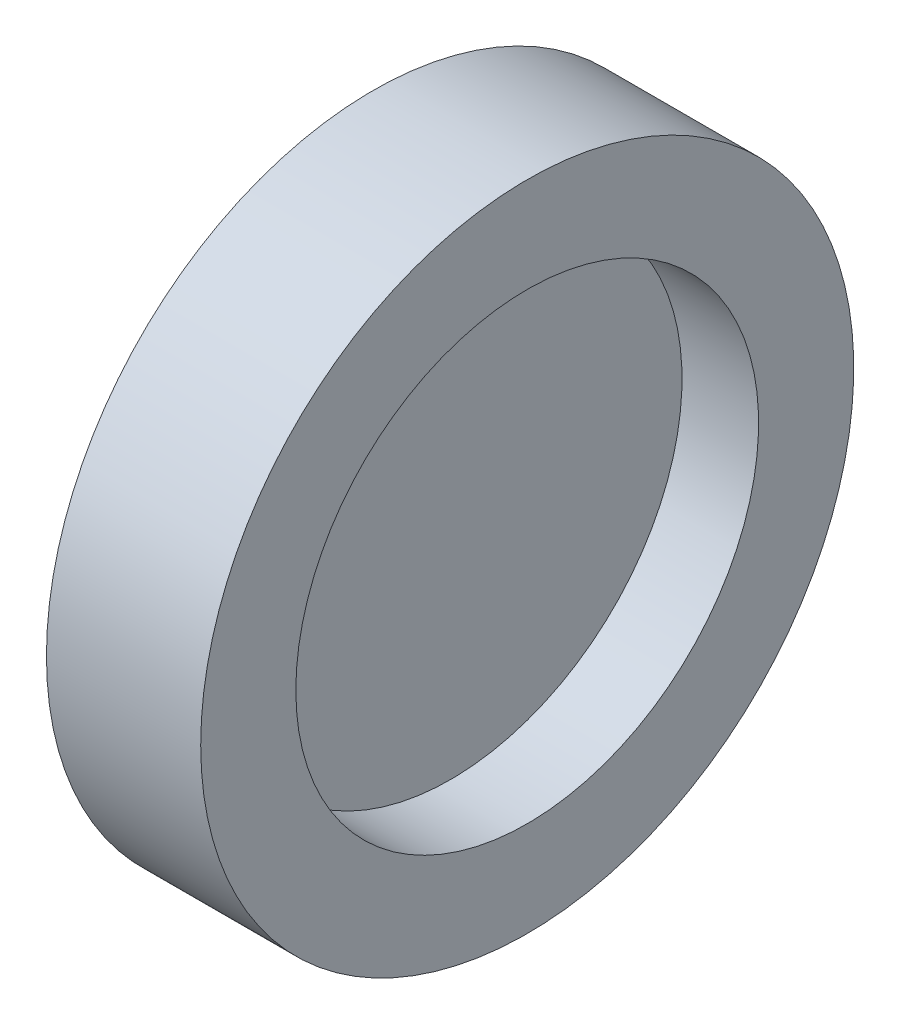
ISO-10303-21;
HEADER;
FILE_DESCRIPTION(('STEP AP214'),'2;1');
FILE_NAME('part.step','',(''),(''),'','','');
FILE_SCHEMA(('AUTOMOTIVE_DESIGN { 1 0 10303 214 1 1 1 1 }'));
ENDSEC;
DATA;
#1=APPLICATION_CONTEXT('core data for automotive mechanical design processes');
#2=APPLICATION_PROTOCOL_DEFINITION('international standard','automotive_design',2000,#1);
#3=PRODUCT_CONTEXT('',#1,'mechanical');
#4=PRODUCT('Part','Part','',(#3));
#5=PRODUCT_RELATED_PRODUCT_CATEGORY('part','',(#4));
#6=PRODUCT_DEFINITION_FORMATION('','',#4);
#7=PRODUCT_DEFINITION_CONTEXT('part definition',#1,'design');
#8=PRODUCT_DEFINITION('design','',#6,#7);
#9=PRODUCT_DEFINITION_SHAPE('','',#8);
#10=(LENGTH_UNIT() NAMED_UNIT(*) SI_UNIT(.MILLI.,.METRE.));
#11=(NAMED_UNIT(*) PLANE_ANGLE_UNIT() SI_UNIT($,.RADIAN.));
#12=(NAMED_UNIT(*) SI_UNIT($,.STERADIAN.) SOLID_ANGLE_UNIT());
#13=UNCERTAINTY_MEASURE_WITH_UNIT(LENGTH_MEASURE(1.E-05),#10,'distance_accuracy_value','');
#14=(GEOMETRIC_REPRESENTATION_CONTEXT(3) GLOBAL_UNCERTAINTY_ASSIGNED_CONTEXT((#13)) GLOBAL_UNIT_ASSIGNED_CONTEXT((#10,
#11,#12)) REPRESENTATION_CONTEXT('',''));
#15=CARTESIAN_POINT('',(0.,0.,0.));
#16=DIRECTION('',(0.,0.,1.));
#17=DIRECTION('',(1.,0.,0.));
#18=AXIS2_PLACEMENT_3D('',#15,#16,#17);
#19=CARTESIAN_POINT('',(0.0215000000000005,9.,0.));
#20=DIRECTION('',(-1.,0.,0.));
#21=DIRECTION('',(0.,0.,1.));
#22=AXIS2_PLACEMENT_3D('',#19,#20,#21);
#23=PLANE('',#22);
#24=CARTESIAN_POINT('',(0.0215000000000011,0.,0.));
#25=DIRECTION('',(-1.,0.,0.));
#26=DIRECTION('',(0.,0.,1.));
#27=AXIS2_PLACEMENT_3D('',#24,#25,#26);
#28=CIRCLE('',#27,9.);
#29=CARTESIAN_POINT('',(0.0215000000000011,0.,9.));
#30=VERTEX_POINT('',#29);
#31=EDGE_CURVE('E10',#30,#30,#28,.T.);
#32=ORIENTED_EDGE('',*,*,#31,.F.);
#33=EDGE_LOOP('',(#32));
#34=FACE_BOUND('',#33,.T.);
#35=ADVANCED_FACE('F37',(#34),#23,.F.);
#36=CARTESIAN_POINT('',(-1.61421241885762,0.,0.));
#37=DIRECTION('',(-1.,0.,0.));
#38=DIRECTION('',(0.,0.,1.));
#39=AXIS2_PLACEMENT_3D('',#36,#37,#38);
#40=CYLINDRICAL_SURFACE('',#39,9.);
#41=CARTESIAN_POINT('',(3.,0.,0.));
#42=DIRECTION('',(-1.,0.,0.));
#43=DIRECTION('',(0.,0.,1.));
#44=AXIS2_PLACEMENT_3D('',#41,#42,#43);
#45=CIRCLE('',#44,9.);
#46=CARTESIAN_POINT('',(3.,0.,9.));
#47=VERTEX_POINT('',#46);
#48=EDGE_CURVE('E60',#47,#47,#45,.T.);
#49=ORIENTED_EDGE('',*,*,#48,.F.);
#50=EDGE_LOOP('',(#49));
#51=FACE_BOUND('',#50,.T.);
#52=ORIENTED_EDGE('',*,*,#31,.T.);
#53=EDGE_LOOP('',(#52));
#54=FACE_BOUND('',#53,.T.);
#55=ADVANCED_FACE('F90',(#51,#54),#40,.F.);
#56=CARTESIAN_POINT('',(-3.,0.,0.));
#57=DIRECTION('',(-1.,0.,0.));
#58=DIRECTION('',(0.,0.,1.));
#59=AXIS2_PLACEMENT_3D('',#56,#57,#58);
#60=CIRCLE('',#59,9.);
#61=CARTESIAN_POINT('',(-3.,0.,9.));
#62=VERTEX_POINT('',#61);
#63=EDGE_CURVE('E64',#62,#62,#60,.T.);
#64=ORIENTED_EDGE('',*,*,#63,.T.);
#65=EDGE_LOOP('',(#64));
#66=FACE_BOUND('',#65,.T.);
#67=CARTESIAN_POINT('',(-0.0215000000000005,0.,0.));
#68=DIRECTION('',(1.,0.,0.));
#69=DIRECTION('',(0.,0.,-1.));
#70=AXIS2_PLACEMENT_3D('',#67,#68,#69);
#71=CIRCLE('',#70,9.);
#72=CARTESIAN_POINT('',(-0.0215000000000005,0.,-9.));
#73=VERTEX_POINT('',#72);
#74=EDGE_CURVE('E44',#73,#73,#71,.T.);
#75=ORIENTED_EDGE('',*,*,#74,.T.);
#76=EDGE_LOOP('',(#75));
#77=FACE_BOUND('',#76,.T.);
#78=ADVANCED_FACE('F69',(#66,#77),#40,.F.);
#79=CARTESIAN_POINT('',(-3.,9.,0.));
#80=DIRECTION('',(1.,0.,0.));
#81=DIRECTION('',(0.,0.,-1.));
#82=AXIS2_PLACEMENT_3D('',#79,#80,#81);
#83=PLANE('',#82);
#84=ORIENTED_EDGE('',*,*,#63,.F.);
#85=EDGE_LOOP('',(#84));
#86=FACE_BOUND('',#85,.T.);
#87=CARTESIAN_POINT('',(-3.,0.,0.));
#88=DIRECTION('',(-1.,0.,0.));
#89=DIRECTION('',(0.,0.,1.));
#90=AXIS2_PLACEMENT_3D('',#87,#88,#89);
#91=CIRCLE('',#90,12.7);
#92=CARTESIAN_POINT('',(-3.,0.,12.7));
#93=VERTEX_POINT('',#92);
#94=EDGE_CURVE('E49',#93,#93,#91,.T.);
#95=ORIENTED_EDGE('',*,*,#94,.T.);
#96=EDGE_LOOP('',(#95));
#97=FACE_BOUND('',#96,.T.);
#98=ADVANCED_FACE('F71',(#86,#97),#83,.F.);
#99=CARTESIAN_POINT('',(-1.61421241885762,0.,0.));
#100=DIRECTION('',(-1.,0.,0.));
#101=DIRECTION('',(0.,0.,1.));
#102=AXIS2_PLACEMENT_3D('',#99,#100,#101);
#103=CYLINDRICAL_SURFACE('',#102,12.7);
#104=ORIENTED_EDGE('',*,*,#94,.F.);
#105=EDGE_LOOP('',(#104));
#106=FACE_BOUND('',#105,.T.);
#107=CARTESIAN_POINT('',(3.,0.,0.));
#108=DIRECTION('',(-1.,0.,0.));
#109=DIRECTION('',(0.,0.,1.));
#110=AXIS2_PLACEMENT_3D('',#107,#108,#109);
#111=CIRCLE('',#110,12.7);
#112=CARTESIAN_POINT('',(3.,0.,12.7));
#113=VERTEX_POINT('',#112);
#114=EDGE_CURVE('E54',#113,#113,#111,.T.);
#115=ORIENTED_EDGE('',*,*,#114,.T.);
#116=EDGE_LOOP('',(#115));
#117=FACE_BOUND('',#116,.T.);
#118=ADVANCED_FACE('F74',(#106,#117),#103,.T.);
#119=CARTESIAN_POINT('',(3.,12.7,0.));
#120=DIRECTION('',(-1.,0.,0.));
#121=DIRECTION('',(0.,0.,1.));
#122=AXIS2_PLACEMENT_3D('',#119,#120,#121);
#123=PLANE('',#122);
#124=ORIENTED_EDGE('',*,*,#114,.F.);
#125=EDGE_LOOP('',(#124));
#126=FACE_BOUND('',#125,.T.);
#127=ORIENTED_EDGE('',*,*,#48,.T.);
#128=EDGE_LOOP('',(#127));
#129=FACE_BOUND('',#128,.T.);
#130=ADVANCED_FACE('F80',(#126,#129),#123,.F.);
#131=CARTESIAN_POINT('',(-0.0215000000000005,9.,0.));
#132=DIRECTION('',(1.,0.,0.));
#133=DIRECTION('',(0.,0.,-1.));
#134=AXIS2_PLACEMENT_3D('',#131,#132,#133);
#135=PLANE('',#134);
#136=ORIENTED_EDGE('',*,*,#74,.F.);
#137=EDGE_LOOP('',(#136));
#138=FACE_BOUND('',#137,.T.);
#139=ADVANCED_FACE('F86',(#138),#135,.F.);
#140=CLOSED_SHELL('',(#35,#55,#78,#98,#118,#130,#139));
#141=MANIFOLD_SOLID_BREP('B2',#140);
#142=ADVANCED_BREP_SHAPE_REPRESENTATION('',(#18,#141),#14);
#143=SHAPE_DEFINITION_REPRESENTATION(#9,#142);
ENDSEC;
END-ISO-10303-21;
